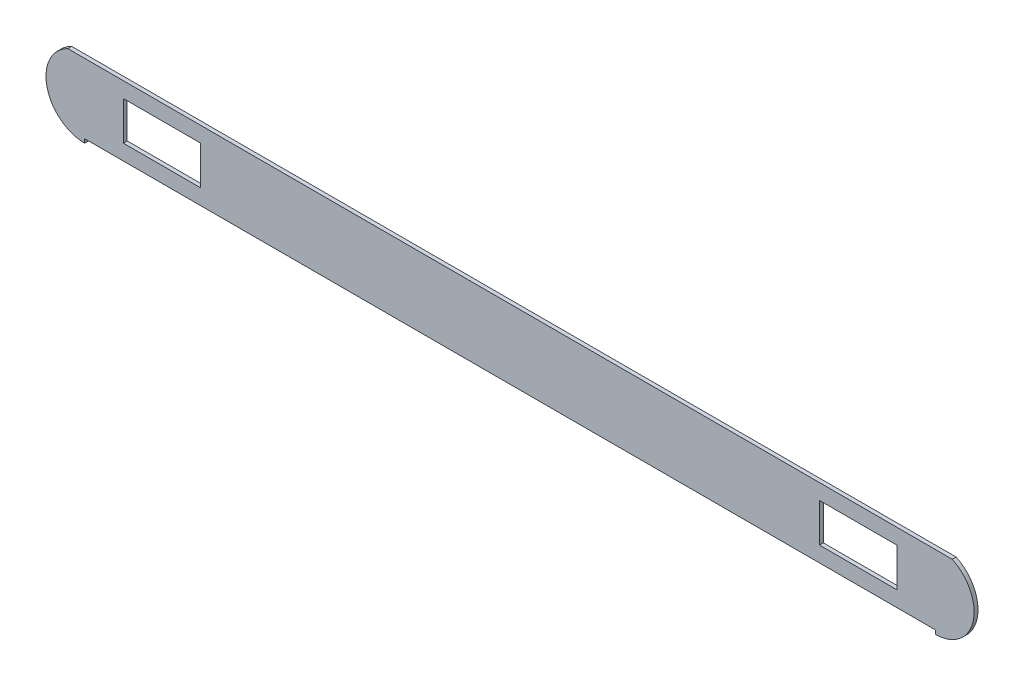
ISO-10303-21;
HEADER;
FILE_DESCRIPTION(('STEP AP214'),'2;1');
FILE_NAME('part.step','',(''),(''),'','','');
FILE_SCHEMA(('AUTOMOTIVE_DESIGN { 1 0 10303 214 1 1 1 1 }'));
ENDSEC;
DATA;
#1=APPLICATION_CONTEXT('core data for automotive mechanical design processes');
#2=APPLICATION_PROTOCOL_DEFINITION('international standard','automotive_design',2000,#1);
#3=PRODUCT_CONTEXT('',#1,'mechanical');
#4=PRODUCT('Part','Part','',(#3));
#5=PRODUCT_RELATED_PRODUCT_CATEGORY('part','',(#4));
#6=PRODUCT_DEFINITION_FORMATION('','',#4);
#7=PRODUCT_DEFINITION_CONTEXT('part definition',#1,'design');
#8=PRODUCT_DEFINITION('design','',#6,#7);
#9=PRODUCT_DEFINITION_SHAPE('','',#8);
#10=(LENGTH_UNIT() NAMED_UNIT(*) SI_UNIT(.MILLI.,.METRE.));
#11=(NAMED_UNIT(*) PLANE_ANGLE_UNIT() SI_UNIT($,.RADIAN.));
#12=(NAMED_UNIT(*) SI_UNIT($,.STERADIAN.) SOLID_ANGLE_UNIT());
#13=UNCERTAINTY_MEASURE_WITH_UNIT(LENGTH_MEASURE(1.E-05),#10,'distance_accuracy_value','');
#14=(GEOMETRIC_REPRESENTATION_CONTEXT(3) GLOBAL_UNCERTAINTY_ASSIGNED_CONTEXT((#13)) GLOBAL_UNIT_ASSIGNED_CONTEXT((#10,
#11,#12)) REPRESENTATION_CONTEXT('',''));
#15=CARTESIAN_POINT('',(0.,0.,0.));
#16=DIRECTION('',(0.,0.,1.));
#17=DIRECTION('',(1.,0.,0.));
#18=AXIS2_PLACEMENT_3D('',#15,#16,#17);
#19=CARTESIAN_POINT('',(0.,45.,0.));
#20=DIRECTION('',(0.,-1.,0.));
#21=DIRECTION('',(0.,0.,-1.));
#22=AXIS2_PLACEMENT_3D('',#19,#20,#21);
#23=PLANE('',#22);
#24=DIRECTION('',(0.,0.,-1.));
#25=VECTOR('',#24,1.);
#26=CARTESIAN_POINT('',(619.060752759772,45.,80.));
#27=LINE('',#26,#25);
#28=CARTESIAN_POINT('',(619.060752759772,45.,0.));
#29=VERTEX_POINT('',#28);
#30=CARTESIAN_POINT('',(619.060752759772,45.,5.));
#31=VERTEX_POINT('',#30);
#32=EDGE_CURVE('E140',#29,#31,#27,.F.);
#33=ORIENTED_EDGE('',*,*,#32,.F.);
#34=DIRECTION('',(1.,0.,0.));
#35=VECTOR('',#34,1.);
#36=CARTESIAN_POINT('',(-502.733741957931,45.,0.));
#37=LINE('',#36,#35);
#38=CARTESIAN_POINT('',(-524.528236675635,45.,0.));
#39=VERTEX_POINT('',#38);
#40=EDGE_CURVE('E144',#39,#29,#37,.T.);
#41=ORIENTED_EDGE('',*,*,#40,.F.);
#42=DIRECTION('',(0.,0.,-1.));
#43=VECTOR('',#42,1.);
#44=CARTESIAN_POINT('',(-524.528236675635,45.,80.));
#45=LINE('',#44,#43);
#46=CARTESIAN_POINT('',(-524.528236675635,45.,5.));
#47=VERTEX_POINT('',#46);
#48=EDGE_CURVE('E142',#47,#39,#45,.T.);
#49=ORIENTED_EDGE('',*,*,#48,.F.);
#50=DIRECTION('',(1.,0.,0.));
#51=VECTOR('',#50,1.);
#52=CARTESIAN_POINT('',(597.266258042068,45.,5.));
#53=LINE('',#52,#51);
#54=EDGE_CURVE('E138',#47,#31,#53,.T.);
#55=ORIENTED_EDGE('',*,*,#54,.T.);
#56=EDGE_LOOP('',(#33,#41,#49,#55));
#57=FACE_BOUND('',#56,.T.);
#58=ADVANCED_FACE('F34',(#57),#23,.F.);
#59=CARTESIAN_POINT('',(547.266258042068,25.,-5.));
#60=DIRECTION('',(1.,0.,0.));
#61=DIRECTION('',(0.,0.,-1.));
#62=AXIS2_PLACEMENT_3D('',#59,#60,#61);
#63=PLANE('',#62);
#64=DIRECTION('',(0.,0.,1.));
#65=VECTOR('',#64,1.);
#66=CARTESIAN_POINT('',(547.266258042068,-25.,-5.));
#67=LINE('',#66,#65);
#68=CARTESIAN_POINT('',(547.266258042068,-25.,0.));
#69=VERTEX_POINT('',#68);
#70=CARTESIAN_POINT('',(547.266258042068,-25.,5.));
#71=VERTEX_POINT('',#70);
#72=EDGE_CURVE('E198',#69,#71,#67,.T.);
#73=ORIENTED_EDGE('',*,*,#72,.T.);
#74=DIRECTION('',(0.,1.,0.));
#75=VECTOR('',#74,1.);
#76=CARTESIAN_POINT('',(547.266258042068,25.,5.));
#77=LINE('',#76,#75);
#78=CARTESIAN_POINT('',(547.266258042068,25.,5.));
#79=VERTEX_POINT('',#78);
#80=EDGE_CURVE('E207',#71,#79,#77,.T.);
#81=ORIENTED_EDGE('',*,*,#80,.T.);
#82=DIRECTION('',(0.,0.,1.));
#83=VECTOR('',#82,1.);
#84=CARTESIAN_POINT('',(547.266258042068,25.,-5.));
#85=LINE('',#84,#83);
#86=CARTESIAN_POINT('',(547.266258042068,25.,0.));
#87=VERTEX_POINT('',#86);
#88=EDGE_CURVE('E200',#87,#79,#85,.T.);
#89=ORIENTED_EDGE('',*,*,#88,.F.);
#90=DIRECTION('',(0.,1.,0.));
#91=VECTOR('',#90,1.);
#92=CARTESIAN_POINT('',(547.266258042068,0.,0.));
#93=LINE('',#92,#91);
#94=EDGE_CURVE('E187',#69,#87,#93,.T.);
#95=ORIENTED_EDGE('',*,*,#94,.F.);
#96=EDGE_LOOP('',(#73,#81,#89,#95));
#97=FACE_BOUND('',#96,.T.);
#98=ADVANCED_FACE('F265',(#97),#63,.F.);
#99=CARTESIAN_POINT('',(447.266258042068,-25.,-5.));
#100=DIRECTION('',(0.,-1.,0.));
#101=DIRECTION('',(0.,0.,-1.));
#102=AXIS2_PLACEMENT_3D('',#99,#100,#101);
#103=PLANE('',#102);
#104=DIRECTION('',(0.,0.,1.));
#105=VECTOR('',#104,1.);
#106=CARTESIAN_POINT('',(447.266258042068,-25.,-5.));
#107=LINE('',#106,#105);
#108=CARTESIAN_POINT('',(447.266258042068,-25.,0.));
#109=VERTEX_POINT('',#108);
#110=CARTESIAN_POINT('',(447.266258042068,-25.,5.));
#111=VERTEX_POINT('',#110);
#112=EDGE_CURVE('E194',#109,#111,#107,.T.);
#113=ORIENTED_EDGE('',*,*,#112,.T.);
#114=DIRECTION('',(1.,0.,0.));
#115=VECTOR('',#114,1.);
#116=CARTESIAN_POINT('',(447.266258042068,-25.,5.));
#117=LINE('',#116,#115);
#118=EDGE_CURVE('E210',#111,#71,#117,.T.);
#119=ORIENTED_EDGE('',*,*,#118,.T.);
#120=ORIENTED_EDGE('',*,*,#72,.F.);
#121=DIRECTION('',(1.,0.,0.));
#122=VECTOR('',#121,1.);
#123=CARTESIAN_POINT('',(-502.733741957931,-25.,0.));
#124=LINE('',#123,#122);
#125=EDGE_CURVE('E190',#109,#69,#124,.T.);
#126=ORIENTED_EDGE('',*,*,#125,.F.);
#127=EDGE_LOOP('',(#113,#119,#120,#126));
#128=FACE_BOUND('',#127,.T.);
#129=ADVANCED_FACE('F270',(#128),#103,.F.);
#130=CARTESIAN_POINT('',(447.266258042068,25.,-5.));
#131=DIRECTION('',(-1.,0.,0.));
#132=DIRECTION('',(0.,0.,1.));
#133=AXIS2_PLACEMENT_3D('',#130,#131,#132);
#134=PLANE('',#133);
#135=DIRECTION('',(0.,0.,1.));
#136=VECTOR('',#135,1.);
#137=CARTESIAN_POINT('',(447.266258042068,25.,-5.));
#138=LINE('',#137,#136);
#139=CARTESIAN_POINT('',(447.266258042068,25.,0.));
#140=VERTEX_POINT('',#139);
#141=CARTESIAN_POINT('',(447.266258042068,25.,5.));
#142=VERTEX_POINT('',#141);
#143=EDGE_CURVE('E202',#140,#142,#138,.T.);
#144=ORIENTED_EDGE('',*,*,#143,.T.);
#145=DIRECTION('',(0.,-1.,0.));
#146=VECTOR('',#145,1.);
#147=CARTESIAN_POINT('',(447.266258042068,25.,5.));
#148=LINE('',#147,#146);
#149=EDGE_CURVE('E213',#142,#111,#148,.T.);
#150=ORIENTED_EDGE('',*,*,#149,.T.);
#151=ORIENTED_EDGE('',*,*,#112,.F.);
#152=DIRECTION('',(0.,-1.,0.));
#153=VECTOR('',#152,1.);
#154=CARTESIAN_POINT('',(447.266258042068,0.,0.));
#155=LINE('',#154,#153);
#156=EDGE_CURVE('E181',#140,#109,#155,.T.);
#157=ORIENTED_EDGE('',*,*,#156,.F.);
#158=EDGE_LOOP('',(#144,#150,#151,#157));
#159=FACE_BOUND('',#158,.T.);
#160=ADVANCED_FACE('F296',(#159),#134,.F.);
#161=CARTESIAN_POINT('',(447.266258042068,25.,-5.));
#162=DIRECTION('',(0.,1.,0.));
#163=DIRECTION('',(-1.,0.,0.));
#164=AXIS2_PLACEMENT_3D('',#161,#162,#163);
#165=PLANE('',#164);
#166=ORIENTED_EDGE('',*,*,#88,.T.);
#167=DIRECTION('',(-1.,0.,0.));
#168=VECTOR('',#167,1.);
#169=CARTESIAN_POINT('',(447.266258042068,25.,5.));
#170=LINE('',#169,#168);
#171=EDGE_CURVE('E197',#79,#142,#170,.T.);
#172=ORIENTED_EDGE('',*,*,#171,.T.);
#173=ORIENTED_EDGE('',*,*,#143,.F.);
#174=DIRECTION('',(-1.,0.,0.));
#175=VECTOR('',#174,1.);
#176=CARTESIAN_POINT('',(-502.733741957931,25.0000000000004,0.));
#177=LINE('',#176,#175);
#178=EDGE_CURVE('E184',#87,#140,#177,.T.);
#179=ORIENTED_EDGE('',*,*,#178,.F.);
#180=EDGE_LOOP('',(#166,#172,#173,#179));
#181=FACE_BOUND('',#180,.T.);
#182=ADVANCED_FACE('F287',(#181),#165,.F.);
#183=CARTESIAN_POINT('',(-352.733741957931,25.,-5.));
#184=DIRECTION('',(1.,0.,0.));
#185=DIRECTION('',(0.,0.,-1.));
#186=AXIS2_PLACEMENT_3D('',#183,#184,#185);
#187=PLANE('',#186);
#188=DIRECTION('',(0.,0.,1.));
#189=VECTOR('',#188,1.);
#190=CARTESIAN_POINT('',(-352.733741957931,-25.,-5.));
#191=LINE('',#190,#189);
#192=CARTESIAN_POINT('',(-352.733741957931,-25.,0.));
#193=VERTEX_POINT('',#192);
#194=CARTESIAN_POINT('',(-352.733741957931,-25.,5.));
#195=VERTEX_POINT('',#194);
#196=EDGE_CURVE('E220',#193,#195,#191,.T.);
#197=ORIENTED_EDGE('',*,*,#196,.T.);
#198=DIRECTION('',(0.,1.,0.));
#199=VECTOR('',#198,1.);
#200=CARTESIAN_POINT('',(-352.733741957931,25.,5.));
#201=LINE('',#200,#199);
#202=CARTESIAN_POINT('',(-352.733741957931,25.,5.));
#203=VERTEX_POINT('',#202);
#204=EDGE_CURVE('E227',#195,#203,#201,.T.);
#205=ORIENTED_EDGE('',*,*,#204,.T.);
#206=DIRECTION('',(0.,0.,1.));
#207=VECTOR('',#206,1.);
#208=CARTESIAN_POINT('',(-352.733741957931,25.,-5.));
#209=LINE('',#208,#207);
#210=CARTESIAN_POINT('',(-352.733741957931,25.,0.));
#211=VERTEX_POINT('',#210);
#212=EDGE_CURVE('E222',#211,#203,#209,.T.);
#213=ORIENTED_EDGE('',*,*,#212,.F.);
#214=DIRECTION('',(0.,1.,0.));
#215=VECTOR('',#214,1.);
#216=CARTESIAN_POINT('',(-352.733741957931,0.,0.));
#217=LINE('',#216,#215);
#218=EDGE_CURVE('E175',#193,#211,#217,.T.);
#219=ORIENTED_EDGE('',*,*,#218,.F.);
#220=EDGE_LOOP('',(#197,#205,#213,#219));
#221=FACE_BOUND('',#220,.T.);
#222=ADVANCED_FACE('F283',(#221),#187,.F.);
#223=CARTESIAN_POINT('',(-452.733741957932,-25.,-5.));
#224=DIRECTION('',(0.,-1.,0.));
#225=DIRECTION('',(0.,0.,-1.));
#226=AXIS2_PLACEMENT_3D('',#223,#224,#225);
#227=PLANE('',#226);
#228=DIRECTION('',(0.,0.,1.));
#229=VECTOR('',#228,1.);
#230=CARTESIAN_POINT('',(-452.733741957932,-25.,-5.));
#231=LINE('',#230,#229);
#232=CARTESIAN_POINT('',(-452.733741957932,-25.,0.));
#233=VERTEX_POINT('',#232);
#234=CARTESIAN_POINT('',(-452.733741957931,-25.,5.));
#235=VERTEX_POINT('',#234);
#236=EDGE_CURVE('E216',#233,#235,#231,.T.);
#237=ORIENTED_EDGE('',*,*,#236,.T.);
#238=DIRECTION('',(1.,0.,0.));
#239=VECTOR('',#238,1.);
#240=CARTESIAN_POINT('',(-452.733741957932,-25.,5.));
#241=LINE('',#240,#239);
#242=EDGE_CURVE('E230',#235,#195,#241,.T.);
#243=ORIENTED_EDGE('',*,*,#242,.T.);
#244=ORIENTED_EDGE('',*,*,#196,.F.);
#245=DIRECTION('',(1.,0.,0.));
#246=VECTOR('',#245,1.);
#247=CARTESIAN_POINT('',(-502.733741957931,-25.,0.));
#248=LINE('',#247,#246);
#249=EDGE_CURVE('E178',#233,#193,#248,.T.);
#250=ORIENTED_EDGE('',*,*,#249,.F.);
#251=EDGE_LOOP('',(#237,#243,#244,#250));
#252=FACE_BOUND('',#251,.T.);
#253=ADVANCED_FACE('F286',(#252),#227,.F.);
#254=CARTESIAN_POINT('',(-452.733741957932,25.,-5.));
#255=DIRECTION('',(-1.,0.,0.));
#256=DIRECTION('',(0.,0.,1.));
#257=AXIS2_PLACEMENT_3D('',#254,#255,#256);
#258=PLANE('',#257);
#259=DIRECTION('',(0.,0.,1.));
#260=VECTOR('',#259,1.);
#261=CARTESIAN_POINT('',(-452.733741957932,25.,-5.));
#262=LINE('',#261,#260);
#263=CARTESIAN_POINT('',(-452.733741957932,25.,0.));
#264=VERTEX_POINT('',#263);
#265=CARTESIAN_POINT('',(-452.733741957932,25.,5.));
#266=VERTEX_POINT('',#265);
#267=EDGE_CURVE('E193',#264,#266,#262,.T.);
#268=ORIENTED_EDGE('',*,*,#267,.T.);
#269=DIRECTION('',(0.,-1.,0.));
#270=VECTOR('',#269,1.);
#271=CARTESIAN_POINT('',(-452.733741957932,25.,5.));
#272=LINE('',#271,#270);
#273=EDGE_CURVE('E204',#266,#235,#272,.T.);
#274=ORIENTED_EDGE('',*,*,#273,.T.);
#275=ORIENTED_EDGE('',*,*,#236,.F.);
#276=DIRECTION('',(0.,-1.,0.));
#277=VECTOR('',#276,1.);
#278=CARTESIAN_POINT('',(-452.733741957932,0.,0.));
#279=LINE('',#278,#277);
#280=EDGE_CURVE('E169',#264,#233,#279,.T.);
#281=ORIENTED_EDGE('',*,*,#280,.F.);
#282=EDGE_LOOP('',(#268,#274,#275,#281));
#283=FACE_BOUND('',#282,.T.);
#284=ADVANCED_FACE('F281',(#283),#258,.F.);
#285=CARTESIAN_POINT('',(-452.733741957932,25.,-5.));
#286=DIRECTION('',(0.,1.,0.));
#287=DIRECTION('',(0.,0.,1.));
#288=AXIS2_PLACEMENT_3D('',#285,#286,#287);
#289=PLANE('',#288);
#290=ORIENTED_EDGE('',*,*,#212,.T.);
#291=DIRECTION('',(-1.,0.,0.));
#292=VECTOR('',#291,1.);
#293=CARTESIAN_POINT('',(-452.733741957932,25.,5.));
#294=LINE('',#293,#292);
#295=EDGE_CURVE('E219',#203,#266,#294,.T.);
#296=ORIENTED_EDGE('',*,*,#295,.T.);
#297=ORIENTED_EDGE('',*,*,#267,.F.);
#298=DIRECTION('',(-1.,0.,0.));
#299=VECTOR('',#298,1.);
#300=CARTESIAN_POINT('',(-502.733741957931,25.,0.));
#301=LINE('',#300,#299);
#302=EDGE_CURVE('E172',#211,#264,#301,.T.);
#303=ORIENTED_EDGE('',*,*,#302,.F.);
#304=EDGE_LOOP('',(#290,#296,#297,#303));
#305=FACE_BOUND('',#304,.T.);
#306=ADVANCED_FACE('F278',(#305),#289,.F.);
#307=CARTESIAN_POINT('',(0.,-45.,0.));
#308=DIRECTION('',(0.,1.,0.));
#309=DIRECTION('',(0.,0.,1.));
#310=AXIS2_PLACEMENT_3D('',#307,#308,#309);
#311=PLANE('',#310);
#312=DIRECTION('',(-1.,0.,0.));
#313=VECTOR('',#312,1.);
#314=CARTESIAN_POINT('',(597.266258042068,-45.,5.));
#315=LINE('',#314,#313);
#316=CARTESIAN_POINT('',(597.266258042068,-45.,5.));
#317=VERTEX_POINT('',#316);
#318=CARTESIAN_POINT('',(-502.733741957931,-45.,5.));
#319=VERTEX_POINT('',#318);
#320=EDGE_CURVE('E162',#317,#319,#315,.T.);
#321=ORIENTED_EDGE('',*,*,#320,.T.);
#322=DIRECTION('',(0.,0.,-1.));
#323=VECTOR('',#322,1.);
#324=CARTESIAN_POINT('',(-502.733741957931,-45.,0.));
#325=LINE('',#324,#323);
#326=CARTESIAN_POINT('',(-502.733741957931,-45.,0.));
#327=VERTEX_POINT('',#326);
#328=EDGE_CURVE('E244',#319,#327,#325,.T.);
#329=ORIENTED_EDGE('',*,*,#328,.T.);
#330=DIRECTION('',(-1.,0.,0.));
#331=VECTOR('',#330,1.);
#332=CARTESIAN_POINT('',(-502.733741957931,-45.,0.));
#333=LINE('',#332,#331);
#334=CARTESIAN_POINT('',(597.266258042068,-45.,0.));
#335=VERTEX_POINT('',#334);
#336=EDGE_CURVE('E164',#335,#327,#333,.T.);
#337=ORIENTED_EDGE('',*,*,#336,.F.);
#338=DIRECTION('',(0.,0.,1.));
#339=VECTOR('',#338,1.);
#340=CARTESIAN_POINT('',(597.266258042068,-45.,0.));
#341=LINE('',#340,#339);
#342=EDGE_CURVE('E238',#335,#317,#341,.T.);
#343=ORIENTED_EDGE('',*,*,#342,.T.);
#344=EDGE_LOOP('',(#321,#329,#337,#343));
#345=FACE_BOUND('',#344,.T.);
#346=ADVANCED_FACE('F252',(#345),#311,.F.);
#347=CARTESIAN_POINT('',(597.266258042068,0.,0.));
#348=DIRECTION('',(-1.,0.,0.));
#349=DIRECTION('',(0.,0.,1.));
#350=AXIS2_PLACEMENT_3D('',#347,#348,#349);
#351=PLANE('',#350);
#352=ORIENTED_EDGE('',*,*,#342,.F.);
#353=DIRECTION('',(0.,-1.,0.));
#354=VECTOR('',#353,1.);
#355=CARTESIAN_POINT('',(597.266258042068,0.,0.));
#356=LINE('',#355,#354);
#357=CARTESIAN_POINT('',(597.266258042068,-50.,0.));
#358=VERTEX_POINT('',#357);
#359=EDGE_CURVE('E234',#335,#358,#356,.T.);
#360=ORIENTED_EDGE('',*,*,#359,.T.);
#361=DIRECTION('',(0.,0.,-1.));
#362=VECTOR('',#361,1.);
#363=CARTESIAN_POINT('',(597.266258042068,-50.,80.));
#364=LINE('',#363,#362);
#365=CARTESIAN_POINT('',(597.266258042068,-50.,5.));
#366=VERTEX_POINT('',#365);
#367=EDGE_CURVE('E215',#366,#358,#364,.T.);
#368=ORIENTED_EDGE('',*,*,#367,.F.);
#369=DIRECTION('',(0.,-1.,0.));
#370=VECTOR('',#369,1.);
#371=CARTESIAN_POINT('',(597.266258042068,-45.,5.));
#372=LINE('',#371,#370);
#373=EDGE_CURVE('E157',#317,#366,#372,.T.);
#374=ORIENTED_EDGE('',*,*,#373,.F.);
#375=EDGE_LOOP('',(#352,#360,#368,#374));
#376=FACE_BOUND('',#375,.T.);
#377=ADVANCED_FACE('F255',(#376),#351,.T.);
#378=CARTESIAN_POINT('',(597.266258042068,0.,80.));
#379=DIRECTION('',(0.,0.,-1.));
#380=DIRECTION('',(-1.,0.,0.));
#381=AXIS2_PLACEMENT_3D('',#378,#379,#380);
#382=CYLINDRICAL_SURFACE('',#381,50.);
#383=CARTESIAN_POINT('',(597.266258042068,0.,0.));
#384=DIRECTION('',(0.,0.,1.));
#385=DIRECTION('',(1.,0.,0.));
#386=AXIS2_PLACEMENT_3D('',#383,#384,#385);
#387=CIRCLE('',#386,50.);
#388=EDGE_CURVE('E145',#358,#29,#387,.T.);
#389=ORIENTED_EDGE('',*,*,#388,.T.);
#390=ORIENTED_EDGE('',*,*,#32,.T.);
#391=CARTESIAN_POINT('',(597.266258042068,0.,5.));
#392=DIRECTION('',(0.,0.,1.));
#393=DIRECTION('',(1.,0.,0.));
#394=AXIS2_PLACEMENT_3D('',#391,#392,#393);
#395=CIRCLE('',#394,50.);
#396=EDGE_CURVE('E150',#366,#31,#395,.T.);
#397=ORIENTED_EDGE('',*,*,#396,.F.);
#398=ORIENTED_EDGE('',*,*,#367,.T.);
#399=EDGE_LOOP('',(#389,#390,#397,#398));
#400=FACE_BOUND('',#399,.T.);
#401=ADVANCED_FACE('F148',(#400),#382,.T.);
#402=CARTESIAN_POINT('',(-502.733741957931,0.,0.));
#403=DIRECTION('',(1.,0.,0.));
#404=DIRECTION('',(0.,0.,-1.));
#405=AXIS2_PLACEMENT_3D('',#402,#403,#404);
#406=PLANE('',#405);
#407=DIRECTION('',(0.,0.,-1.));
#408=VECTOR('',#407,1.);
#409=CARTESIAN_POINT('',(-502.733741957931,-50.,80.));
#410=LINE('',#409,#408);
#411=CARTESIAN_POINT('',(-502.733741957931,-50.,5.));
#412=VERTEX_POINT('',#411);
#413=CARTESIAN_POINT('',(-502.733741957931,-50.,0.));
#414=VERTEX_POINT('',#413);
#415=EDGE_CURVE('E11',#412,#414,#410,.T.);
#416=ORIENTED_EDGE('',*,*,#415,.T.);
#417=DIRECTION('',(0.,1.,0.));
#418=VECTOR('',#417,1.);
#419=CARTESIAN_POINT('',(-502.733741957931,0.,0.));
#420=LINE('',#419,#418);
#421=EDGE_CURVE('E43',#414,#327,#420,.T.);
#422=ORIENTED_EDGE('',*,*,#421,.T.);
#423=ORIENTED_EDGE('',*,*,#328,.F.);
#424=DIRECTION('',(0.,1.,0.));
#425=VECTOR('',#424,1.);
#426=CARTESIAN_POINT('',(-502.733741957931,-45.,5.));
#427=LINE('',#426,#425);
#428=EDGE_CURVE('E237',#412,#319,#427,.T.);
#429=ORIENTED_EDGE('',*,*,#428,.F.);
#430=EDGE_LOOP('',(#416,#422,#423,#429));
#431=FACE_BOUND('',#430,.T.);
#432=ADVANCED_FACE('F249',(#431),#406,.T.);
#433=CARTESIAN_POINT('',(-502.733741957931,0.,0.));
#434=DIRECTION('',(0.,0.,1.));
#435=DIRECTION('',(1.,0.,0.));
#436=AXIS2_PLACEMENT_3D('',#433,#434,#435);
#437=PLANE('',#436);
#438=CARTESIAN_POINT('',(-502.733741957931,0.,0.));
#439=DIRECTION('',(0.,0.,1.));
#440=DIRECTION('',(1.,0.,0.));
#441=AXIS2_PLACEMENT_3D('',#438,#439,#440);
#442=CIRCLE('',#441,50.);
#443=EDGE_CURVE('E38',#39,#414,#442,.T.);
#444=ORIENTED_EDGE('',*,*,#443,.F.);
#445=ORIENTED_EDGE('',*,*,#40,.T.);
#446=ORIENTED_EDGE('',*,*,#388,.F.);
#447=ORIENTED_EDGE('',*,*,#359,.F.);
#448=ORIENTED_EDGE('',*,*,#336,.T.);
#449=ORIENTED_EDGE('',*,*,#421,.F.);
#450=EDGE_LOOP('',(#444,#445,#446,#447,#448,#449));
#451=FACE_BOUND('',#450,.T.);
#452=ORIENTED_EDGE('',*,*,#302,.T.);
#453=ORIENTED_EDGE('',*,*,#280,.T.);
#454=ORIENTED_EDGE('',*,*,#249,.T.);
#455=ORIENTED_EDGE('',*,*,#218,.T.);
#456=EDGE_LOOP('',(#452,#453,#454,#455));
#457=FACE_BOUND('',#456,.T.);
#458=ORIENTED_EDGE('',*,*,#178,.T.);
#459=ORIENTED_EDGE('',*,*,#156,.T.);
#460=ORIENTED_EDGE('',*,*,#125,.T.);
#461=ORIENTED_EDGE('',*,*,#94,.T.);
#462=EDGE_LOOP('',(#458,#459,#460,#461));
#463=FACE_BOUND('',#462,.T.);
#464=ADVANCED_FACE('F36',(#451,#457,#463),#437,.F.);
#465=CARTESIAN_POINT('',(597.266258042068,-45.,5.));
#466=DIRECTION('',(0.,0.,1.));
#467=DIRECTION('',(1.,0.,0.));
#468=AXIS2_PLACEMENT_3D('',#465,#466,#467);
#469=PLANE('',#468);
#470=ORIENTED_EDGE('',*,*,#54,.F.);
#471=CARTESIAN_POINT('',(-502.733741957931,0.,5.));
#472=DIRECTION('',(0.,0.,1.));
#473=DIRECTION('',(1.,0.,0.));
#474=AXIS2_PLACEMENT_3D('',#471,#472,#473);
#475=CIRCLE('',#474,50.);
#476=EDGE_CURVE('E58',#47,#412,#475,.T.);
#477=ORIENTED_EDGE('',*,*,#476,.T.);
#478=ORIENTED_EDGE('',*,*,#428,.T.);
#479=ORIENTED_EDGE('',*,*,#320,.F.);
#480=ORIENTED_EDGE('',*,*,#373,.T.);
#481=ORIENTED_EDGE('',*,*,#396,.T.);
#482=EDGE_LOOP('',(#470,#477,#478,#479,#480,#481));
#483=FACE_BOUND('',#482,.T.);
#484=ORIENTED_EDGE('',*,*,#273,.F.);
#485=ORIENTED_EDGE('',*,*,#295,.F.);
#486=ORIENTED_EDGE('',*,*,#204,.F.);
#487=ORIENTED_EDGE('',*,*,#242,.F.);
#488=EDGE_LOOP('',(#484,#485,#486,#487));
#489=FACE_BOUND('',#488,.T.);
#490=ORIENTED_EDGE('',*,*,#149,.F.);
#491=ORIENTED_EDGE('',*,*,#171,.F.);
#492=ORIENTED_EDGE('',*,*,#80,.F.);
#493=ORIENTED_EDGE('',*,*,#118,.F.);
#494=EDGE_LOOP('',(#490,#491,#492,#493));
#495=FACE_BOUND('',#494,.T.);
#496=ADVANCED_FACE('F154',(#483,#489,#495),#469,.T.);
#497=CARTESIAN_POINT('',(-502.733741957931,0.,80.));
#498=DIRECTION('',(0.,0.,-1.));
#499=DIRECTION('',(-1.,0.,0.));
#500=AXIS2_PLACEMENT_3D('',#497,#498,#499);
#501=CYLINDRICAL_SURFACE('',#500,50.);
#502=ORIENTED_EDGE('',*,*,#476,.F.);
#503=ORIENTED_EDGE('',*,*,#48,.T.);
#504=ORIENTED_EDGE('',*,*,#443,.T.);
#505=ORIENTED_EDGE('',*,*,#415,.F.);
#506=EDGE_LOOP('',(#502,#503,#504,#505));
#507=FACE_BOUND('',#506,.T.);
#508=ADVANCED_FACE('F258',(#507),#501,.T.);
#509=CLOSED_SHELL('',(#58,#98,#129,#160,#182,#222,#253,#284,#306,#346,#377,#401,#432,#464,#496,#508));
#510=MANIFOLD_SOLID_BREP('B2',#509);
#511=ADVANCED_BREP_SHAPE_REPRESENTATION('',(#18,#510),#14);
#512=SHAPE_DEFINITION_REPRESENTATION(#9,#511);
ENDSEC;
END-ISO-10303-21;
